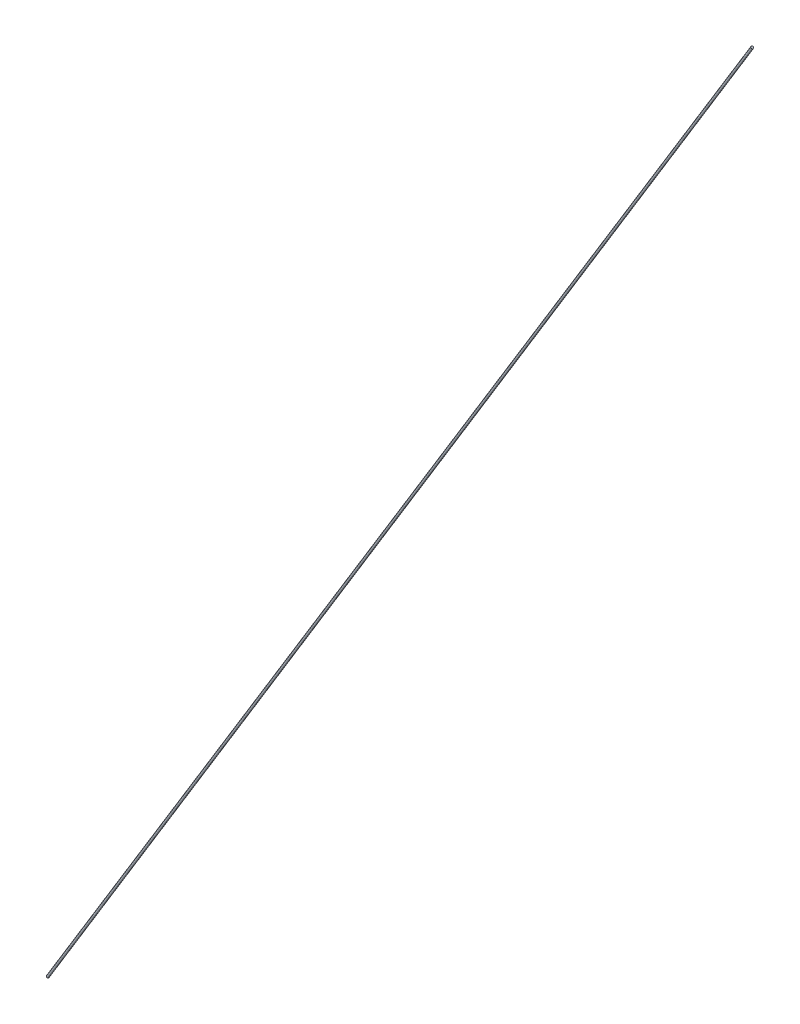
ISO-10303-21;
HEADER;
FILE_DESCRIPTION(('STEP AP214'),'2;1');
FILE_NAME('part.step','',(''),(''),'','','');
FILE_SCHEMA(('AUTOMOTIVE_DESIGN { 1 0 10303 214 1 1 1 1 }'));
ENDSEC;
DATA;
#1=APPLICATION_CONTEXT('core data for automotive mechanical design processes');
#2=APPLICATION_PROTOCOL_DEFINITION('international standard','automotive_design',2000,#1);
#3=PRODUCT_CONTEXT('',#1,'mechanical');
#4=PRODUCT('Part','Part','',(#3));
#5=PRODUCT_RELATED_PRODUCT_CATEGORY('part','',(#4));
#6=PRODUCT_DEFINITION_FORMATION('','',#4);
#7=PRODUCT_DEFINITION_CONTEXT('part definition',#1,'design');
#8=PRODUCT_DEFINITION('design','',#6,#7);
#9=PRODUCT_DEFINITION_SHAPE('','',#8);
#10=(LENGTH_UNIT() NAMED_UNIT(*) SI_UNIT(.MILLI.,.METRE.));
#11=(NAMED_UNIT(*) PLANE_ANGLE_UNIT() SI_UNIT($,.RADIAN.));
#12=(NAMED_UNIT(*) SI_UNIT($,.STERADIAN.) SOLID_ANGLE_UNIT());
#13=UNCERTAINTY_MEASURE_WITH_UNIT(LENGTH_MEASURE(1.E-05),#10,'distance_accuracy_value','');
#14=(GEOMETRIC_REPRESENTATION_CONTEXT(3) GLOBAL_UNCERTAINTY_ASSIGNED_CONTEXT((#13)) GLOBAL_UNIT_ASSIGNED_CONTEXT((#10,
#11,#12)) REPRESENTATION_CONTEXT('',''));
#15=CARTESIAN_POINT('',(0.,0.,0.));
#16=DIRECTION('',(0.,0.,1.));
#17=DIRECTION('',(1.,0.,0.));
#18=AXIS2_PLACEMENT_3D('',#15,#16,#17);
#19=CARTESIAN_POINT('',(307.5,505.,0.));
#20=DIRECTION('',(-0.520081079703551,-0.854116895122904,0.));
#21=DIRECTION('',(0.854116895122904,-0.520081079703551,0.));
#22=AXIS2_PLACEMENT_3D('',#19,#20,#21);
#23=PLANE('',#22);
#24=CARTESIAN_POINT('',(307.5,505.,0.));
#25=DIRECTION('',(-0.520081079703551,-0.854116895122904,0.));
#26=DIRECTION('',(0.854116895122904,-0.520081079703551,0.));
#27=AXIS2_PLACEMENT_3D('',#24,#25,#26);
#28=CIRCLE('',#27,0.499999999999993);
#29=CARTESIAN_POINT('',(307.927058447561,504.739959460148,0.));
#30=VERTEX_POINT('',#29);
#31=EDGE_CURVE('E47',#30,#30,#28,.T.);
#32=ORIENTED_EDGE('',*,*,#31,.F.);
#33=EDGE_LOOP('',(#32));
#34=FACE_BOUND('',#33,.T.);
#35=ADVANCED_FACE('F41',(#34),#23,.F.);
#36=CARTESIAN_POINT('',(0.,2.22044604925031E-13,0.));
#37=DIRECTION('',(-0.520081079703551,-0.854116895122904,0.));
#38=DIRECTION('',(0.854116895122904,-0.520081079703551,0.));
#39=AXIS2_PLACEMENT_3D('',#36,#37,#38);
#40=PLANE('',#39);
#41=CARTESIAN_POINT('',(0.,2.22044604925031E-13,0.));
#42=DIRECTION('',(-0.520081079703551,-0.854116895122904,0.));
#43=DIRECTION('',(0.854116895122904,-0.520081079703551,0.));
#44=AXIS2_PLACEMENT_3D('',#41,#42,#43);
#45=CIRCLE('',#44,0.499999999999993);
#46=CARTESIAN_POINT('',(0.427058447561446,-0.26004053985155,0.));
#47=VERTEX_POINT('',#46);
#48=EDGE_CURVE('E11',#47,#47,#45,.T.);
#49=ORIENTED_EDGE('',*,*,#48,.T.);
#50=EDGE_LOOP('',(#49));
#51=FACE_BOUND('',#50,.T.);
#52=ADVANCED_FACE('F56',(#51),#40,.T.);
#53=CARTESIAN_POINT('',(307.5,505.,0.));
#54=DIRECTION('',(-0.52008107970355,-0.854116895122904,0.));
#55=DIRECTION('',(0.854116895122904,-0.52008107970355,0.));
#56=AXIS2_PLACEMENT_3D('',#53,#54,#55);
#57=CYLINDRICAL_SURFACE('',#56,0.499999999999993);
#58=ORIENTED_EDGE('',*,*,#48,.F.);
#59=EDGE_LOOP('',(#58));
#60=FACE_BOUND('',#59,.T.);
#61=ORIENTED_EDGE('',*,*,#31,.T.);
#62=EDGE_LOOP('',(#61));
#63=FACE_BOUND('',#62,.T.);
#64=ADVANCED_FACE('F53',(#60,#63),#57,.T.);
#65=CLOSED_SHELL('',(#35,#52,#64));
#66=MANIFOLD_SOLID_BREP('B2',#65);
#67=ADVANCED_BREP_SHAPE_REPRESENTATION('',(#18,#66),#14);
#68=SHAPE_DEFINITION_REPRESENTATION(#9,#67);
ENDSEC;
END-ISO-10303-21;
